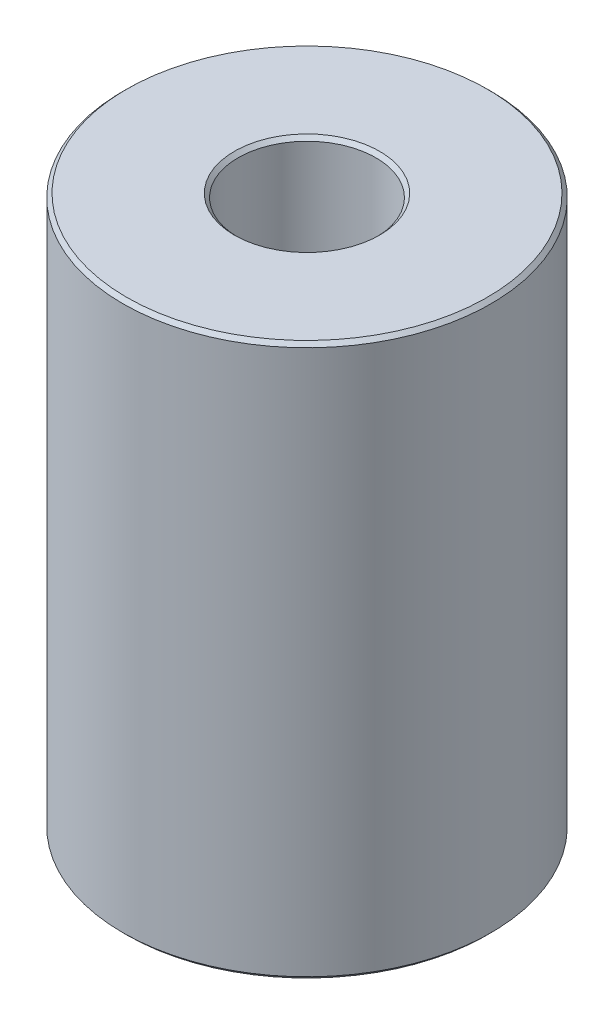
ISO-10303-21;
HEADER;
FILE_DESCRIPTION(('STEP AP214'),'2;1');
FILE_NAME('part.step','',(''),(''),'','','');
FILE_SCHEMA(('AUTOMOTIVE_DESIGN { 1 0 10303 214 1 1 1 1 }'));
ENDSEC;
DATA;
#1=APPLICATION_CONTEXT('core data for automotive mechanical design processes');
#2=APPLICATION_PROTOCOL_DEFINITION('international standard','automotive_design',2000,#1);
#3=PRODUCT_CONTEXT('',#1,'mechanical');
#4=PRODUCT('Part','Part','',(#3));
#5=PRODUCT_RELATED_PRODUCT_CATEGORY('part','',(#4));
#6=PRODUCT_DEFINITION_FORMATION('','',#4);
#7=PRODUCT_DEFINITION_CONTEXT('part definition',#1,'design');
#8=PRODUCT_DEFINITION('design','',#6,#7);
#9=PRODUCT_DEFINITION_SHAPE('','',#8);
#10=(LENGTH_UNIT() NAMED_UNIT(*) SI_UNIT(.MILLI.,.METRE.));
#11=(NAMED_UNIT(*) PLANE_ANGLE_UNIT() SI_UNIT($,.RADIAN.));
#12=(NAMED_UNIT(*) SI_UNIT($,.STERADIAN.) SOLID_ANGLE_UNIT());
#13=UNCERTAINTY_MEASURE_WITH_UNIT(LENGTH_MEASURE(1.E-05),#10,'distance_accuracy_value','');
#14=(GEOMETRIC_REPRESENTATION_CONTEXT(3) GLOBAL_UNCERTAINTY_ASSIGNED_CONTEXT((#13)) GLOBAL_UNIT_ASSIGNED_CONTEXT((#10,
#11,#12)) REPRESENTATION_CONTEXT('',''));
#15=CARTESIAN_POINT('',(0.,0.,0.));
#16=DIRECTION('',(0.,0.,1.));
#17=DIRECTION('',(1.,0.,0.));
#18=AXIS2_PLACEMENT_3D('',#15,#16,#17);
#19=CARTESIAN_POINT('',(0.,37.5008350422237,0.));
#20=DIRECTION('',(0.,-1.,0.));
#21=DIRECTION('',(0.,0.,-1.));
#22=AXIS2_PLACEMENT_3D('',#19,#20,#21);
#23=CYLINDRICAL_SURFACE('',#22,12.5);
#24=CARTESIAN_POINT('',(0.,0.253157677436187,0.));
#25=DIRECTION('',(0.,1.,0.));
#26=DIRECTION('',(0.,0.,1.));
#27=AXIS2_PLACEMENT_3D('',#24,#25,#26);
#28=CIRCLE('',#27,12.5);
#29=CARTESIAN_POINT('',(0.,0.253157677436187,12.5));
#30=VERTEX_POINT('',#29);
#31=EDGE_CURVE('E10',#30,#30,#28,.T.);
#32=ORIENTED_EDGE('',*,*,#31,.T.);
#33=EDGE_LOOP('',(#32));
#34=FACE_BOUND('',#33,.T.);
#35=CARTESIAN_POINT('',(0.,37.2492847687665,0.));
#36=DIRECTION('',(0.,1.,0.));
#37=DIRECTION('',(0.,0.,1.));
#38=AXIS2_PLACEMENT_3D('',#35,#36,#37);
#39=CIRCLE('',#38,12.5);
#40=CARTESIAN_POINT('',(0.,37.2492847687665,12.5));
#41=VERTEX_POINT('',#40);
#42=EDGE_CURVE('E50',#41,#41,#39,.F.);
#43=ORIENTED_EDGE('',*,*,#42,.T.);
#44=EDGE_LOOP('',(#43));
#45=FACE_BOUND('',#44,.T.);
#46=ADVANCED_FACE('F39',(#34,#45),#23,.T.);
#47=CARTESIAN_POINT('',(0.,37.5008350422237,0.));
#48=DIRECTION('',(0.,1.,0.));
#49=DIRECTION('',(0.,0.,1.));
#50=AXIS2_PLACEMENT_3D('',#47,#48,#49);
#51=PLANE('',#50);
#52=CARTESIAN_POINT('',(0.,37.5008350422237,0.));
#53=DIRECTION('',(0.,1.,0.));
#54=DIRECTION('',(0.,0.,1.));
#55=AXIS2_PLACEMENT_3D('',#52,#53,#54);
#56=CIRCLE('',#55,4.93376736393322);
#57=CARTESIAN_POINT('',(0.,37.5008350422237,4.93376736393322));
#58=VERTEX_POINT('',#57);
#59=EDGE_CURVE('E58',#58,#58,#56,.F.);
#60=ORIENTED_EDGE('',*,*,#59,.T.);
#61=EDGE_LOOP('',(#60));
#62=FACE_BOUND('',#61,.T.);
#63=CARTESIAN_POINT('',(0.,37.5008350422237,0.));
#64=DIRECTION('',(0.,1.,0.));
#65=DIRECTION('',(0.,0.,1.));
#66=AXIS2_PLACEMENT_3D('',#63,#64,#65);
#67=CIRCLE('',#66,12.2468423225638);
#68=CARTESIAN_POINT('',(0.,37.5008350422237,12.2468423225638));
#69=VERTEX_POINT('',#68);
#70=EDGE_CURVE('E61',#69,#69,#67,.T.);
#71=ORIENTED_EDGE('',*,*,#70,.T.);
#72=EDGE_LOOP('',(#71));
#73=FACE_BOUND('',#72,.T.);
#74=ADVANCED_FACE('F88',(#62,#73),#51,.T.);
#75=CARTESIAN_POINT('',(0.,0.,0.));
#76=DIRECTION('',(0.,1.,0.));
#77=DIRECTION('',(0.,0.,1.));
#78=AXIS2_PLACEMENT_3D('',#75,#76,#77);
#79=PLANE('',#78);
#80=CARTESIAN_POINT('',(0.,0.,0.));
#81=DIRECTION('',(0.,1.,0.));
#82=DIRECTION('',(0.,0.,1.));
#83=AXIS2_PLACEMENT_3D('',#80,#81,#82);
#84=CIRCLE('',#83,4.93537476791223);
#85=CARTESIAN_POINT('',(0.,0.,4.93537476791223));
#86=VERTEX_POINT('',#85);
#87=EDGE_CURVE('E51',#86,#86,#84,.T.);
#88=ORIENTED_EDGE('',*,*,#87,.T.);
#89=EDGE_LOOP('',(#88));
#90=FACE_BOUND('',#89,.T.);
#91=CARTESIAN_POINT('',(0.,0.,0.));
#92=DIRECTION('',(0.,1.,0.));
#93=DIRECTION('',(0.,0.,1.));
#94=AXIS2_PLACEMENT_3D('',#91,#92,#93);
#95=CIRCLE('',#94,12.2484497265428);
#96=CARTESIAN_POINT('',(0.,0.,12.2484497265428));
#97=VERTEX_POINT('',#96);
#98=EDGE_CURVE('E54',#97,#97,#95,.F.);
#99=ORIENTED_EDGE('',*,*,#98,.T.);
#100=EDGE_LOOP('',(#99));
#101=FACE_BOUND('',#100,.T.);
#102=ADVANCED_FACE('F83',(#90,#101),#79,.F.);
#103=CARTESIAN_POINT('',(0.,37.5008350422237,0.));
#104=DIRECTION('',(0.,-1.,0.));
#105=DIRECTION('',(0.,0.,-1.));
#106=AXIS2_PLACEMENT_3D('',#103,#104,#105);
#107=CYLINDRICAL_SURFACE('',#106,4.68221709047605);
#108=CARTESIAN_POINT('',(0.,37.2476773647875,0.));
#109=DIRECTION('',(0.,1.,0.));
#110=DIRECTION('',(0.,0.,1.));
#111=AXIS2_PLACEMENT_3D('',#108,#109,#110);
#112=CIRCLE('',#111,4.68221709047605);
#113=CARTESIAN_POINT('',(0.,37.2476773647875,4.68221709047605));
#114=VERTEX_POINT('',#113);
#115=EDGE_CURVE('E67',#114,#114,#112,.T.);
#116=ORIENTED_EDGE('',*,*,#115,.T.);
#117=EDGE_LOOP('',(#116));
#118=FACE_BOUND('',#117,.T.);
#119=CARTESIAN_POINT('',(0.,0.25155027345717,0.));
#120=DIRECTION('',(0.,1.,0.));
#121=DIRECTION('',(0.,0.,1.));
#122=AXIS2_PLACEMENT_3D('',#119,#120,#121);
#123=CIRCLE('',#122,4.68221709047605);
#124=CARTESIAN_POINT('',(0.,0.25155027345717,4.68221709047605));
#125=VERTEX_POINT('',#124);
#126=EDGE_CURVE('E69',#125,#125,#123,.F.);
#127=ORIENTED_EDGE('',*,*,#126,.T.);
#128=EDGE_LOOP('',(#127));
#129=FACE_BOUND('',#128,.T.);
#130=ADVANCED_FACE('F71',(#118,#129),#107,.F.);
#131=CARTESIAN_POINT('',(0.,37.2476773647875,0.));
#132=DIRECTION('',(0.,1.,0.));
#133=DIRECTION('',(0.,0.,1.));
#134=AXIS2_PLACEMENT_3D('',#131,#132,#133);
#135=CONICAL_SURFACE('',#134,4.68221709047605,0.782213354159675);
#136=ORIENTED_EDGE('',*,*,#59,.F.);
#137=EDGE_LOOP('',(#136));
#138=FACE_BOUND('',#137,.T.);
#139=ORIENTED_EDGE('',*,*,#115,.F.);
#140=EDGE_LOOP('',(#139));
#141=FACE_BOUND('',#140,.T.);
#142=ADVANCED_FACE('F77',(#138,#141),#135,.F.);
#143=CARTESIAN_POINT('',(0.,0.,0.));
#144=DIRECTION('',(0.,-1.,0.));
#145=DIRECTION('',(0.,0.,-1.));
#146=AXIS2_PLACEMENT_3D('',#143,#144,#145);
#147=CONICAL_SURFACE('',#146,4.93537476791223,0.788582972635208);
#148=ORIENTED_EDGE('',*,*,#126,.F.);
#149=EDGE_LOOP('',(#148));
#150=FACE_BOUND('',#149,.T.);
#151=ORIENTED_EDGE('',*,*,#87,.F.);
#152=EDGE_LOOP('',(#151));
#153=FACE_BOUND('',#152,.T.);
#154=ADVANCED_FACE('F73',(#150,#153),#147,.F.);
#155=CARTESIAN_POINT('',(0.,0.253157677436187,0.));
#156=DIRECTION('',(0.,1.,0.));
#157=DIRECTION('',(0.,0.,1.));
#158=AXIS2_PLACEMENT_3D('',#155,#156,#157);
#159=CONICAL_SURFACE('',#158,12.5,0.782213354159686);
#160=ORIENTED_EDGE('',*,*,#98,.F.);
#161=EDGE_LOOP('',(#160));
#162=FACE_BOUND('',#161,.T.);
#163=ORIENTED_EDGE('',*,*,#31,.F.);
#164=EDGE_LOOP('',(#163));
#165=FACE_BOUND('',#164,.T.);
#166=ADVANCED_FACE('F76',(#162,#165),#159,.T.);
#167=CARTESIAN_POINT('',(0.,37.5008350422237,0.));
#168=DIRECTION('',(0.,-1.,0.));
#169=DIRECTION('',(0.,0.,-1.));
#170=AXIS2_PLACEMENT_3D('',#167,#168,#169);
#171=CONICAL_SURFACE('',#170,12.2468423225638,0.788582972635197);
#172=ORIENTED_EDGE('',*,*,#42,.F.);
#173=EDGE_LOOP('',(#172));
#174=FACE_BOUND('',#173,.T.);
#175=ORIENTED_EDGE('',*,*,#70,.F.);
#176=EDGE_LOOP('',(#175));
#177=FACE_BOUND('',#176,.T.);
#178=ADVANCED_FACE('F45',(#174,#177),#171,.T.);
#179=CLOSED_SHELL('',(#46,#74,#102,#130,#142,#154,#166,#178));
#180=MANIFOLD_SOLID_BREP('B2',#179);
#181=ADVANCED_BREP_SHAPE_REPRESENTATION('',(#18,#180),#14);
#182=SHAPE_DEFINITION_REPRESENTATION(#9,#181);
ENDSEC;
END-ISO-10303-21;
